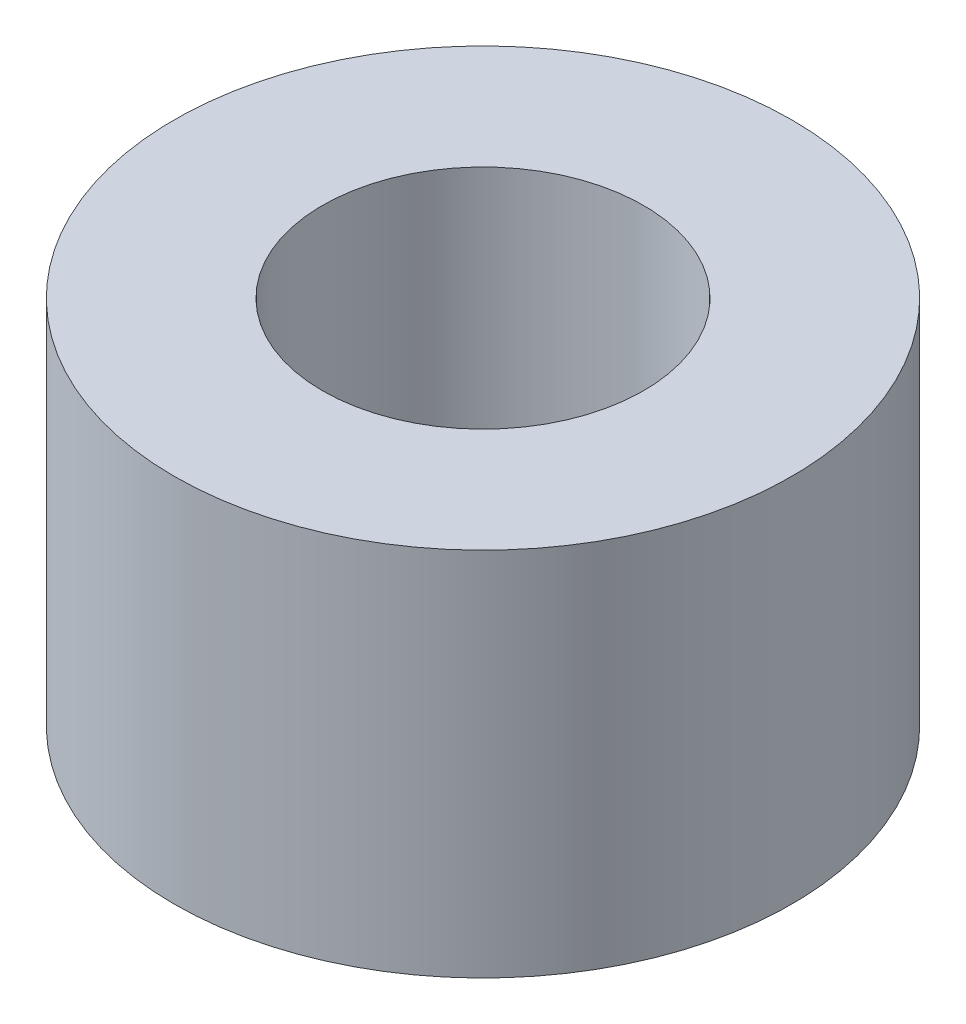
ISO-10303-21;
HEADER;
FILE_DESCRIPTION(('STEP AP214'),'2;1');
FILE_NAME('part.step','',(''),(''),'','','');
FILE_SCHEMA(('AUTOMOTIVE_DESIGN { 1 0 10303 214 1 1 1 1 }'));
ENDSEC;
DATA;
#1=APPLICATION_CONTEXT('core data for automotive mechanical design processes');
#2=APPLICATION_PROTOCOL_DEFINITION('international standard','automotive_design',2000,#1);
#3=PRODUCT_CONTEXT('',#1,'mechanical');
#4=PRODUCT('Part','Part','',(#3));
#5=PRODUCT_RELATED_PRODUCT_CATEGORY('part','',(#4));
#6=PRODUCT_DEFINITION_FORMATION('','',#4);
#7=PRODUCT_DEFINITION_CONTEXT('part definition',#1,'design');
#8=PRODUCT_DEFINITION('design','',#6,#7);
#9=PRODUCT_DEFINITION_SHAPE('','',#8);
#10=(LENGTH_UNIT() NAMED_UNIT(*) SI_UNIT(.MILLI.,.METRE.));
#11=(NAMED_UNIT(*) PLANE_ANGLE_UNIT() SI_UNIT($,.RADIAN.));
#12=(NAMED_UNIT(*) SI_UNIT($,.STERADIAN.) SOLID_ANGLE_UNIT());
#13=UNCERTAINTY_MEASURE_WITH_UNIT(LENGTH_MEASURE(1.E-05),#10,'distance_accuracy_value','');
#14=(GEOMETRIC_REPRESENTATION_CONTEXT(3) GLOBAL_UNCERTAINTY_ASSIGNED_CONTEXT((#13)) GLOBAL_UNIT_ASSIGNED_CONTEXT((#10,
#11,#12)) REPRESENTATION_CONTEXT('',''));
#15=CARTESIAN_POINT('',(0.,0.,0.));
#16=DIRECTION('',(0.,0.,1.));
#17=DIRECTION('',(1.,0.,0.));
#18=AXIS2_PLACEMENT_3D('',#15,#16,#17);
#19=CARTESIAN_POINT('',(0.,15.,0.));
#20=DIRECTION('',(0.,1.,0.));
#21=DIRECTION('',(0.,0.,1.));
#22=AXIS2_PLACEMENT_3D('',#19,#20,#21);
#23=PLANE('',#22);
#24=CARTESIAN_POINT('',(0.,15.,0.));
#25=DIRECTION('',(0.,1.,0.));
#26=DIRECTION('',(0.,0.,1.));
#27=AXIS2_PLACEMENT_3D('',#24,#25,#26);
#28=CIRCLE('',#27,12.5);
#29=CARTESIAN_POINT('',(0.,15.,12.5));
#30=VERTEX_POINT('',#29);
#31=EDGE_CURVE('E10',#30,#30,#28,.T.);
#32=ORIENTED_EDGE('',*,*,#31,.T.);
#33=EDGE_LOOP('',(#32));
#34=FACE_BOUND('',#33,.T.);
#35=CARTESIAN_POINT('',(0.,15.,0.));
#36=DIRECTION('',(0.,1.,0.));
#37=DIRECTION('',(0.,0.,1.));
#38=AXIS2_PLACEMENT_3D('',#35,#36,#37);
#39=CIRCLE('',#38,6.5);
#40=CARTESIAN_POINT('',(0.,15.,6.5));
#41=VERTEX_POINT('',#40);
#42=EDGE_CURVE('E44',#41,#41,#39,.T.);
#43=ORIENTED_EDGE('',*,*,#42,.F.);
#44=EDGE_LOOP('',(#43));
#45=FACE_BOUND('',#44,.T.);
#46=ADVANCED_FACE('F33',(#34,#45),#23,.T.);
#47=CARTESIAN_POINT('',(0.,0.,0.));
#48=DIRECTION('',(0.,1.,0.));
#49=DIRECTION('',(0.,0.,1.));
#50=AXIS2_PLACEMENT_3D('',#47,#48,#49);
#51=PLANE('',#50);
#52=CARTESIAN_POINT('',(0.,0.,0.));
#53=DIRECTION('',(0.,1.,0.));
#54=DIRECTION('',(0.,0.,1.));
#55=AXIS2_PLACEMENT_3D('',#52,#53,#54);
#56=CIRCLE('',#55,12.5);
#57=CARTESIAN_POINT('',(0.,0.,12.5));
#58=VERTEX_POINT('',#57);
#59=EDGE_CURVE('E37',#58,#58,#56,.T.);
#60=ORIENTED_EDGE('',*,*,#59,.F.);
#61=EDGE_LOOP('',(#60));
#62=FACE_BOUND('',#61,.T.);
#63=CARTESIAN_POINT('',(0.,0.,0.));
#64=DIRECTION('',(0.,1.,0.));
#65=DIRECTION('',(0.,0.,1.));
#66=AXIS2_PLACEMENT_3D('',#63,#64,#65);
#67=CIRCLE('',#66,6.5);
#68=CARTESIAN_POINT('',(0.,0.,6.5));
#69=VERTEX_POINT('',#68);
#70=EDGE_CURVE('E46',#69,#69,#67,.T.);
#71=ORIENTED_EDGE('',*,*,#70,.T.);
#72=EDGE_LOOP('',(#71));
#73=FACE_BOUND('',#72,.T.);
#74=ADVANCED_FACE('F56',(#62,#73),#51,.F.);
#75=CARTESIAN_POINT('',(0.,15.,0.));
#76=DIRECTION('',(0.,-1.,0.));
#77=DIRECTION('',(0.,0.,-1.));
#78=AXIS2_PLACEMENT_3D('',#75,#76,#77);
#79=CYLINDRICAL_SURFACE('',#78,12.5);
#80=ORIENTED_EDGE('',*,*,#31,.F.);
#81=EDGE_LOOP('',(#80));
#82=FACE_BOUND('',#81,.T.);
#83=ORIENTED_EDGE('',*,*,#59,.T.);
#84=EDGE_LOOP('',(#83));
#85=FACE_BOUND('',#84,.T.);
#86=ADVANCED_FACE('F35',(#82,#85),#79,.T.);
#87=CARTESIAN_POINT('',(0.,15.,0.));
#88=DIRECTION('',(0.,-1.,0.));
#89=DIRECTION('',(0.,0.,-1.));
#90=AXIS2_PLACEMENT_3D('',#87,#88,#89);
#91=CYLINDRICAL_SURFACE('',#90,6.5);
#92=ORIENTED_EDGE('',*,*,#42,.T.);
#93=EDGE_LOOP('',(#92));
#94=FACE_BOUND('',#93,.T.);
#95=ORIENTED_EDGE('',*,*,#70,.F.);
#96=EDGE_LOOP('',(#95));
#97=FACE_BOUND('',#96,.T.);
#98=ADVANCED_FACE('F52',(#94,#97),#91,.F.);
#99=CLOSED_SHELL('',(#46,#74,#86,#98));
#100=MANIFOLD_SOLID_BREP('B2',#99);
#101=ADVANCED_BREP_SHAPE_REPRESENTATION('',(#18,#100),#14);
#102=SHAPE_DEFINITION_REPRESENTATION(#9,#101);
ENDSEC;
END-ISO-10303-21;
